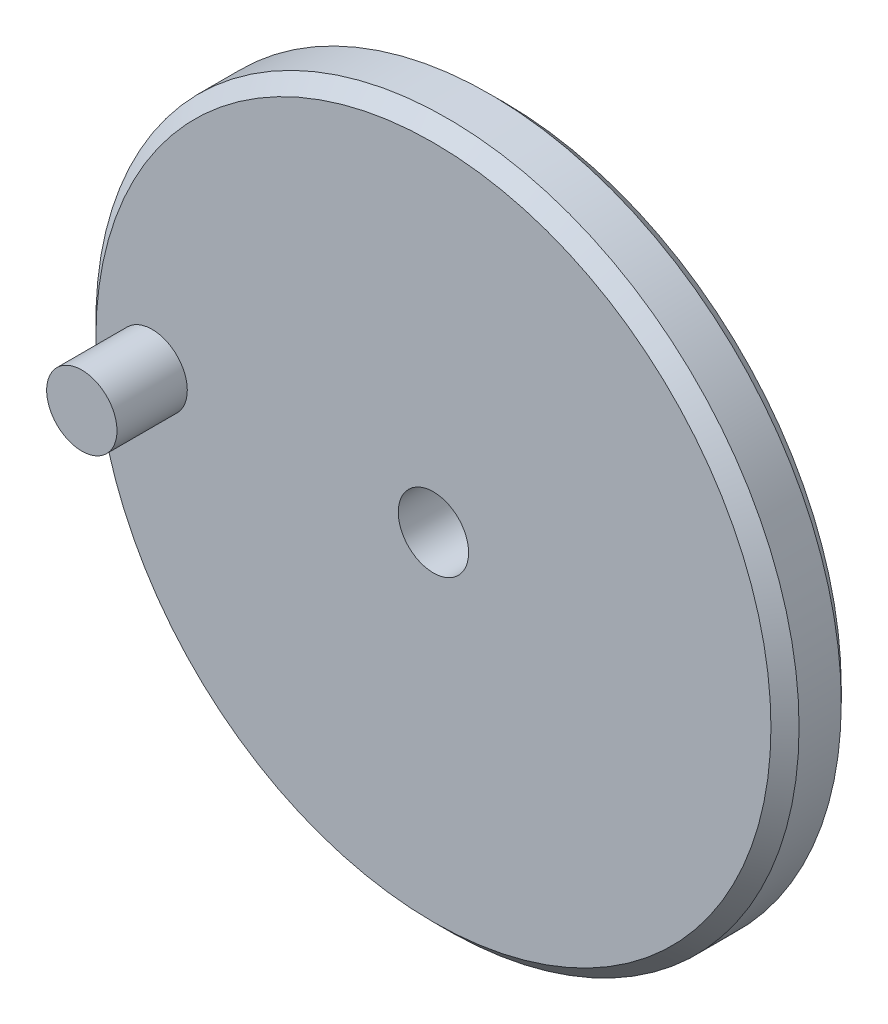
ISO-10303-21;
HEADER;
FILE_DESCRIPTION(('STEP AP214'),'2;1');
FILE_NAME('part.step','',(''),(''),'','','');
FILE_SCHEMA(('AUTOMOTIVE_DESIGN { 1 0 10303 214 1 1 1 1 }'));
ENDSEC;
DATA;
#1=APPLICATION_CONTEXT('core data for automotive mechanical design processes');
#2=APPLICATION_PROTOCOL_DEFINITION('international standard','automotive_design',2000,#1);
#3=PRODUCT_CONTEXT('',#1,'mechanical');
#4=PRODUCT('Part','Part','',(#3));
#5=PRODUCT_RELATED_PRODUCT_CATEGORY('part','',(#4));
#6=PRODUCT_DEFINITION_FORMATION('','',#4);
#7=PRODUCT_DEFINITION_CONTEXT('part definition',#1,'design');
#8=PRODUCT_DEFINITION('design','',#6,#7);
#9=PRODUCT_DEFINITION_SHAPE('','',#8);
#10=(LENGTH_UNIT() NAMED_UNIT(*) SI_UNIT(.MILLI.,.METRE.));
#11=(NAMED_UNIT(*) PLANE_ANGLE_UNIT() SI_UNIT($,.RADIAN.));
#12=(NAMED_UNIT(*) SI_UNIT($,.STERADIAN.) SOLID_ANGLE_UNIT());
#13=UNCERTAINTY_MEASURE_WITH_UNIT(LENGTH_MEASURE(1.E-05),#10,'distance_accuracy_value','');
#14=(GEOMETRIC_REPRESENTATION_CONTEXT(3) GLOBAL_UNCERTAINTY_ASSIGNED_CONTEXT((#13)) GLOBAL_UNIT_ASSIGNED_CONTEXT((#10,
#11,#12)) REPRESENTATION_CONTEXT('',''));
#15=CARTESIAN_POINT('',(0.,0.,0.));
#16=DIRECTION('',(0.,0.,1.));
#17=DIRECTION('',(1.,0.,0.));
#18=AXIS2_PLACEMENT_3D('',#15,#16,#17);
#19=CARTESIAN_POINT('',(0.,0.,5.));
#20=DIRECTION('',(0.,0.,1.));
#21=DIRECTION('',(1.,0.,0.));
#22=AXIS2_PLACEMENT_3D('',#19,#20,#21);
#23=PLANE('',#22);
#24=CARTESIAN_POINT('',(0.,0.,5.));
#25=DIRECTION('',(0.,0.,1.));
#26=DIRECTION('',(1.,0.,0.));
#27=AXIS2_PLACEMENT_3D('',#24,#25,#26);
#28=CIRCLE('',#27,24.);
#29=CARTESIAN_POINT('',(24.,0.,5.));
#30=VERTEX_POINT('',#29);
#31=EDGE_CURVE('E59',#30,#30,#28,.T.);
#32=ORIENTED_EDGE('',*,*,#31,.T.);
#33=EDGE_LOOP('',(#32));
#34=FACE_BOUND('',#33,.T.);
#35=CARTESIAN_POINT('',(-20.,0.,5.));
#36=DIRECTION('',(0.,0.,1.));
#37=DIRECTION('',(1.,0.,0.));
#38=AXIS2_PLACEMENT_3D('',#35,#36,#37);
#39=CIRCLE('',#38,2.5);
#40=CARTESIAN_POINT('',(-17.5,0.,5.));
#41=VERTEX_POINT('',#40);
#42=EDGE_CURVE('E71',#41,#41,#39,.T.);
#43=ORIENTED_EDGE('',*,*,#42,.F.);
#44=EDGE_LOOP('',(#43));
#45=FACE_BOUND('',#44,.T.);
#46=CARTESIAN_POINT('',(0.,0.,5.));
#47=DIRECTION('',(0.,0.,1.));
#48=DIRECTION('',(1.,0.,0.));
#49=AXIS2_PLACEMENT_3D('',#46,#47,#48);
#50=CIRCLE('',#49,2.5);
#51=CARTESIAN_POINT('',(2.5,0.,5.));
#52=VERTEX_POINT('',#51);
#53=EDGE_CURVE('E64',#52,#52,#50,.T.);
#54=ORIENTED_EDGE('',*,*,#53,.F.);
#55=EDGE_LOOP('',(#54));
#56=FACE_BOUND('',#55,.T.);
#57=ADVANCED_FACE('F43',(#34,#45,#56),#23,.T.);
#58=CARTESIAN_POINT('',(0.,0.,0.));
#59=DIRECTION('',(0.,0.,1.));
#60=DIRECTION('',(1.,0.,0.));
#61=AXIS2_PLACEMENT_3D('',#58,#59,#60);
#62=PLANE('',#61);
#63=CARTESIAN_POINT('',(0.,0.,0.));
#64=DIRECTION('',(0.,0.,1.));
#65=DIRECTION('',(1.,0.,0.));
#66=AXIS2_PLACEMENT_3D('',#63,#64,#65);
#67=CIRCLE('',#66,24.);
#68=CARTESIAN_POINT('',(24.,0.,0.));
#69=VERTEX_POINT('',#68);
#70=EDGE_CURVE('E10',#69,#69,#67,.F.);
#71=ORIENTED_EDGE('',*,*,#70,.T.);
#72=EDGE_LOOP('',(#71));
#73=FACE_BOUND('',#72,.T.);
#74=CARTESIAN_POINT('',(0.,0.,0.));
#75=DIRECTION('',(0.,0.,1.));
#76=DIRECTION('',(1.,0.,0.));
#77=AXIS2_PLACEMENT_3D('',#74,#75,#76);
#78=CIRCLE('',#77,2.5);
#79=CARTESIAN_POINT('',(2.5,0.,0.));
#80=VERTEX_POINT('',#79);
#81=EDGE_CURVE('E65',#80,#80,#78,.T.);
#82=ORIENTED_EDGE('',*,*,#81,.T.);
#83=EDGE_LOOP('',(#82));
#84=FACE_BOUND('',#83,.T.);
#85=ADVANCED_FACE('F88',(#73,#84),#62,.F.);
#86=CARTESIAN_POINT('',(0.,0.,5.));
#87=DIRECTION('',(0.,0.,-1.));
#88=DIRECTION('',(-1.,0.,0.));
#89=AXIS2_PLACEMENT_3D('',#86,#87,#88);
#90=CYLINDRICAL_SURFACE('',#89,25.);
#91=CARTESIAN_POINT('',(0.,0.,4.00000000000002));
#92=DIRECTION('',(0.,0.,1.));
#93=DIRECTION('',(1.,0.,0.));
#94=AXIS2_PLACEMENT_3D('',#91,#92,#93);
#95=CIRCLE('',#94,25.);
#96=CARTESIAN_POINT('',(25.,0.,4.00000000000002));
#97=VERTEX_POINT('',#96);
#98=EDGE_CURVE('E51',#97,#97,#95,.F.);
#99=ORIENTED_EDGE('',*,*,#98,.T.);
#100=EDGE_LOOP('',(#99));
#101=FACE_BOUND('',#100,.T.);
#102=CARTESIAN_POINT('',(0.,0.,1.));
#103=DIRECTION('',(0.,0.,1.));
#104=DIRECTION('',(1.,0.,0.));
#105=AXIS2_PLACEMENT_3D('',#102,#103,#104);
#106=CIRCLE('',#105,25.);
#107=CARTESIAN_POINT('',(25.,0.,1.));
#108=VERTEX_POINT('',#107);
#109=EDGE_CURVE('E55',#108,#108,#106,.T.);
#110=ORIENTED_EDGE('',*,*,#109,.T.);
#111=EDGE_LOOP('',(#110));
#112=FACE_BOUND('',#111,.T.);
#113=ADVANCED_FACE('F95',(#101,#112),#90,.T.);
#114=CARTESIAN_POINT('',(0.,0.,5.));
#115=DIRECTION('',(0.,0.,-1.));
#116=DIRECTION('',(-1.,0.,0.));
#117=AXIS2_PLACEMENT_3D('',#114,#115,#116);
#118=CYLINDRICAL_SURFACE('',#117,2.5);
#119=ORIENTED_EDGE('',*,*,#53,.T.);
#120=EDGE_LOOP('',(#119));
#121=FACE_BOUND('',#120,.T.);
#122=ORIENTED_EDGE('',*,*,#81,.F.);
#123=EDGE_LOOP('',(#122));
#124=FACE_BOUND('',#123,.T.);
#125=ADVANCED_FACE('F82',(#121,#124),#118,.F.);
#126=CARTESIAN_POINT('',(-20.,0.,10.));
#127=DIRECTION('',(0.,0.,-1.));
#128=DIRECTION('',(-1.,0.,0.));
#129=AXIS2_PLACEMENT_3D('',#126,#127,#128);
#130=CYLINDRICAL_SURFACE('',#129,2.5);
#131=CARTESIAN_POINT('',(-20.,0.,10.));
#132=DIRECTION('',(0.,0.,1.));
#133=DIRECTION('',(1.,0.,0.));
#134=AXIS2_PLACEMENT_3D('',#131,#132,#133);
#135=CIRCLE('',#134,2.5);
#136=CARTESIAN_POINT('',(-17.5,0.,10.));
#137=VERTEX_POINT('',#136);
#138=EDGE_CURVE('E68',#137,#137,#135,.T.);
#139=ORIENTED_EDGE('',*,*,#138,.F.);
#140=EDGE_LOOP('',(#139));
#141=FACE_BOUND('',#140,.T.);
#142=ORIENTED_EDGE('',*,*,#42,.T.);
#143=EDGE_LOOP('',(#142));
#144=FACE_BOUND('',#143,.T.);
#145=ADVANCED_FACE('F79',(#141,#144),#130,.T.);
#146=CARTESIAN_POINT('',(-20.,0.,10.));
#147=DIRECTION('',(0.,0.,1.));
#148=DIRECTION('',(1.,0.,0.));
#149=AXIS2_PLACEMENT_3D('',#146,#147,#148);
#150=PLANE('',#149);
#151=ORIENTED_EDGE('',*,*,#138,.T.);
#152=EDGE_LOOP('',(#151));
#153=FACE_BOUND('',#152,.T.);
#154=ADVANCED_FACE('F77',(#153),#150,.T.);
#155=CARTESIAN_POINT('',(0.,0.,5.));
#156=DIRECTION('',(0.,0.,-1.));
#157=DIRECTION('',(-1.,0.,0.));
#158=AXIS2_PLACEMENT_3D('',#155,#156,#157);
#159=CONICAL_SURFACE('',#158,24.,0.78539816339745);
#160=ORIENTED_EDGE('',*,*,#98,.F.);
#161=EDGE_LOOP('',(#160));
#162=FACE_BOUND('',#161,.T.);
#163=ORIENTED_EDGE('',*,*,#31,.F.);
#164=EDGE_LOOP('',(#163));
#165=FACE_BOUND('',#164,.T.);
#166=ADVANCED_FACE('F106',(#162,#165),#159,.T.);
#167=CARTESIAN_POINT('',(0.,0.,1.));
#168=DIRECTION('',(0.,0.,1.));
#169=DIRECTION('',(1.,0.,0.));
#170=AXIS2_PLACEMENT_3D('',#167,#168,#169);
#171=CONICAL_SURFACE('',#170,25.,0.785398163397452);
#172=ORIENTED_EDGE('',*,*,#70,.F.);
#173=EDGE_LOOP('',(#172));
#174=FACE_BOUND('',#173,.T.);
#175=ORIENTED_EDGE('',*,*,#109,.F.);
#176=EDGE_LOOP('',(#175));
#177=FACE_BOUND('',#176,.T.);
#178=ADVANCED_FACE('F46',(#174,#177),#171,.T.);
#179=CLOSED_SHELL('',(#57,#85,#113,#125,#145,#154,#166,#178));
#180=MANIFOLD_SOLID_BREP('B2',#179);
#181=ADVANCED_BREP_SHAPE_REPRESENTATION('',(#18,#180),#14);
#182=SHAPE_DEFINITION_REPRESENTATION(#9,#181);
ENDSEC;
END-ISO-10303-21;
